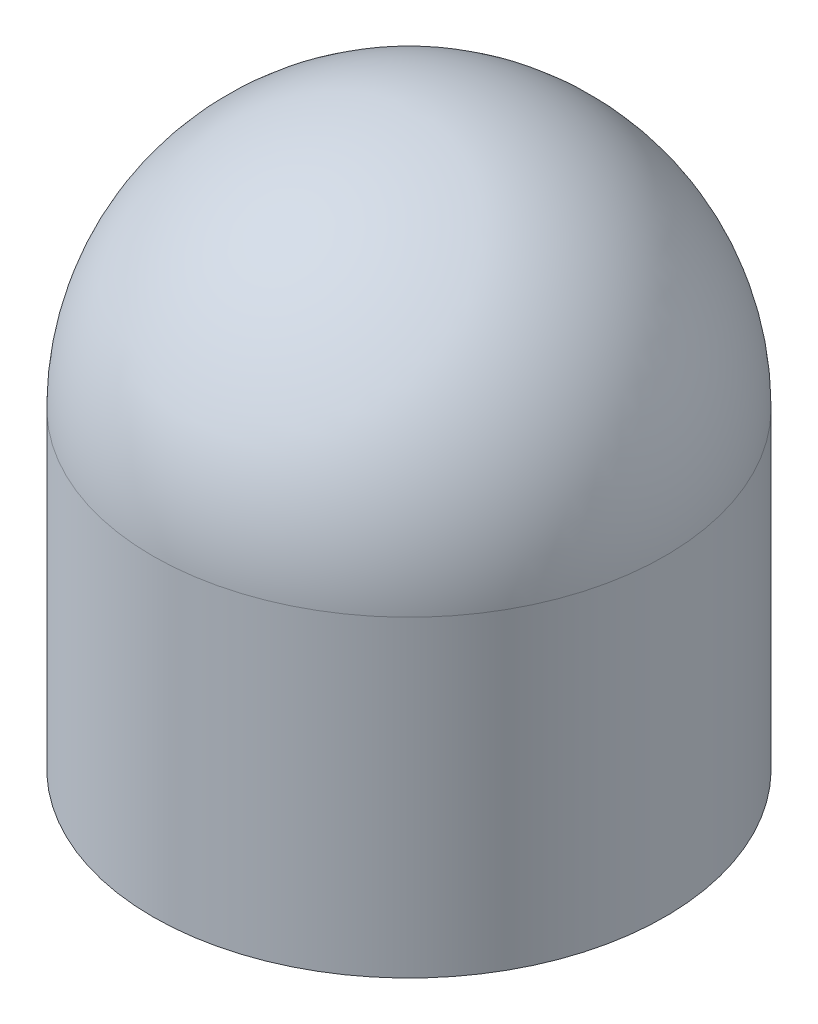
ISO-10303-21;
HEADER;
FILE_DESCRIPTION(('STEP AP214'),'2;1');
FILE_NAME('part.step','',(''),(''),'','','');
FILE_SCHEMA(('AUTOMOTIVE_DESIGN { 1 0 10303 214 1 1 1 1 }'));
ENDSEC;
DATA;
#1=APPLICATION_CONTEXT('core data for automotive mechanical design processes');
#2=APPLICATION_PROTOCOL_DEFINITION('international standard','automotive_design',2000,#1);
#3=PRODUCT_CONTEXT('',#1,'mechanical');
#4=PRODUCT('Part','Part','',(#3));
#5=PRODUCT_RELATED_PRODUCT_CATEGORY('part','',(#4));
#6=PRODUCT_DEFINITION_FORMATION('','',#4);
#7=PRODUCT_DEFINITION_CONTEXT('part definition',#1,'design');
#8=PRODUCT_DEFINITION('design','',#6,#7);
#9=PRODUCT_DEFINITION_SHAPE('','',#8);
#10=(LENGTH_UNIT() NAMED_UNIT(*) SI_UNIT(.MILLI.,.METRE.));
#11=(NAMED_UNIT(*) PLANE_ANGLE_UNIT() SI_UNIT($,.RADIAN.));
#12=(NAMED_UNIT(*) SI_UNIT($,.STERADIAN.) SOLID_ANGLE_UNIT());
#13=UNCERTAINTY_MEASURE_WITH_UNIT(LENGTH_MEASURE(1.E-05),#10,'distance_accuracy_value','');
#14=(GEOMETRIC_REPRESENTATION_CONTEXT(3) GLOBAL_UNCERTAINTY_ASSIGNED_CONTEXT((#13)) GLOBAL_UNIT_ASSIGNED_CONTEXT((#10,
#11,#12)) REPRESENTATION_CONTEXT('',''));
#15=CARTESIAN_POINT('',(0.,0.,0.));
#16=DIRECTION('',(0.,0.,1.));
#17=DIRECTION('',(1.,0.,0.));
#18=AXIS2_PLACEMENT_3D('',#15,#16,#17);
#19=CARTESIAN_POINT('',(0.,6.1,0.));
#20=DIRECTION('',(0.,-1.,0.));
#21=DIRECTION('',(0.,0.,-1.));
#22=AXIS2_PLACEMENT_3D('',#19,#20,#21);
#23=CYLINDRICAL_SURFACE('',#22,5.);
#24=CARTESIAN_POINT('',(0.,6.1,0.));
#25=DIRECTION('',(0.,1.,0.));
#26=DIRECTION('',(0.,0.,1.));
#27=AXIS2_PLACEMENT_3D('',#24,#25,#26);
#28=CIRCLE('',#27,5.);
#29=CARTESIAN_POINT('',(0.,6.1,5.));
#30=VERTEX_POINT('',#29);
#31=EDGE_CURVE('E10',#30,#30,#28,.T.);
#32=ORIENTED_EDGE('',*,*,#31,.F.);
#33=EDGE_LOOP('',(#32));
#34=FACE_BOUND('',#33,.T.);
#35=CARTESIAN_POINT('',(0.,0.,0.));
#36=DIRECTION('',(0.,1.,0.));
#37=DIRECTION('',(0.,0.,1.));
#38=AXIS2_PLACEMENT_3D('',#35,#36,#37);
#39=CIRCLE('',#38,5.);
#40=CARTESIAN_POINT('',(0.,0.,5.));
#41=VERTEX_POINT('',#40);
#42=EDGE_CURVE('E34',#41,#41,#39,.T.);
#43=ORIENTED_EDGE('',*,*,#42,.T.);
#44=EDGE_LOOP('',(#43));
#45=FACE_BOUND('',#44,.T.);
#46=ADVANCED_FACE('F31',(#34,#45),#23,.T.);
#47=CARTESIAN_POINT('',(0.,0.,0.));
#48=DIRECTION('',(0.,1.,0.));
#49=DIRECTION('',(0.,0.,1.));
#50=AXIS2_PLACEMENT_3D('',#47,#48,#49);
#51=PLANE('',#50);
#52=ORIENTED_EDGE('',*,*,#42,.F.);
#53=EDGE_LOOP('',(#52));
#54=FACE_BOUND('',#53,.T.);
#55=ADVANCED_FACE('F44',(#54),#51,.F.);
#56=CARTESIAN_POINT('',(0.,6.1,0.));
#57=DIRECTION('',(0.,0.,-1.));
#58=DIRECTION('',(-1.,0.,0.));
#59=AXIS2_PLACEMENT_3D('',#56,#57,#58);
#60=SPHERICAL_SURFACE('',#59,5.);
#61=CARTESIAN_POINT('',(0.,6.1,0.));
#62=DIRECTION('',(0.,1.,0.));
#63=DIRECTION('',(0.,0.,1.));
#64=AXIS2_PLACEMENT_3D('',#61,#62,#63);
#65=SPHERICAL_SURFACE('',#64,5.);
#66=ORIENTED_EDGE('',*,*,#31,.T.);
#67=EDGE_LOOP('',(#66));
#68=FACE_BOUND('',#67,.T.);
#69=ADVANCED_FACE('F46',(#68),#65,.T.);
#70=CLOSED_SHELL('',(#46,#55,#69));
#71=MANIFOLD_SOLID_BREP('B2',#70);
#72=ADVANCED_BREP_SHAPE_REPRESENTATION('',(#18,#71),#14);
#73=SHAPE_DEFINITION_REPRESENTATION(#9,#72);
ENDSEC;
END-ISO-10303-21;
